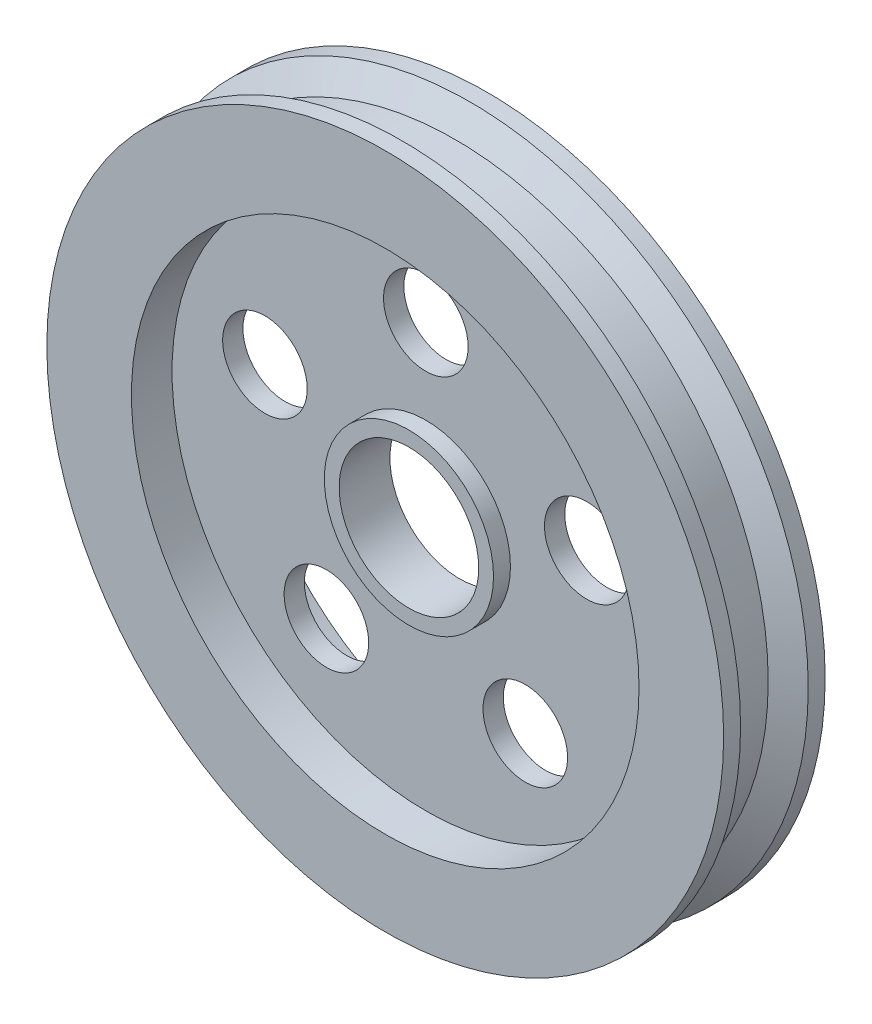
ISO-10303-21;
HEADER;
FILE_DESCRIPTION(('STEP AP214'),'2;1');
FILE_NAME('part.step','',(''),(''),'','','');
FILE_SCHEMA(('AUTOMOTIVE_DESIGN { 1 0 10303 214 1 1 1 1 }'));
ENDSEC;
DATA;
#1=APPLICATION_CONTEXT('core data for automotive mechanical design processes');
#2=APPLICATION_PROTOCOL_DEFINITION('international standard','automotive_design',2000,#1);
#3=PRODUCT_CONTEXT('',#1,'mechanical');
#4=PRODUCT('Part','Part','',(#3));
#5=PRODUCT_RELATED_PRODUCT_CATEGORY('part','',(#4));
#6=PRODUCT_DEFINITION_FORMATION('','',#4);
#7=PRODUCT_DEFINITION_CONTEXT('part definition',#1,'design');
#8=PRODUCT_DEFINITION('design','',#6,#7);
#9=PRODUCT_DEFINITION_SHAPE('','',#8);
#10=(LENGTH_UNIT() NAMED_UNIT(*) SI_UNIT(.MILLI.,.METRE.));
#11=(NAMED_UNIT(*) PLANE_ANGLE_UNIT() SI_UNIT($,.RADIAN.));
#12=(NAMED_UNIT(*) SI_UNIT($,.STERADIAN.) SOLID_ANGLE_UNIT());
#13=UNCERTAINTY_MEASURE_WITH_UNIT(LENGTH_MEASURE(1.E-05),#10,'distance_accuracy_value','');
#14=(GEOMETRIC_REPRESENTATION_CONTEXT(3) GLOBAL_UNCERTAINTY_ASSIGNED_CONTEXT((#13)) GLOBAL_UNIT_ASSIGNED_CONTEXT((#10,
#11,#12)) REPRESENTATION_CONTEXT('',''));
#15=CARTESIAN_POINT('',(0.,0.,0.));
#16=DIRECTION('',(0.,0.,1.));
#17=DIRECTION('',(1.,0.,0.));
#18=AXIS2_PLACEMENT_3D('',#15,#16,#17);
#19=CARTESIAN_POINT('',(0.,0.,3.));
#20=DIRECTION('',(0.,0.,-1.));
#21=DIRECTION('',(-1.,0.,0.));
#22=AXIS2_PLACEMENT_3D('',#19,#20,#21);
#23=CYLINDRICAL_SURFACE('',#22,20.);
#24=CARTESIAN_POINT('',(0.,0.,-2.));
#25=DIRECTION('',(0.,0.,1.));
#26=DIRECTION('',(1.,0.,0.));
#27=AXIS2_PLACEMENT_3D('',#24,#25,#26);
#28=CIRCLE('',#27,20.);
#29=CARTESIAN_POINT('',(20.,0.,-2.));
#30=VERTEX_POINT('',#29);
#31=EDGE_CURVE('E68',#30,#30,#28,.T.);
#32=ORIENTED_EDGE('',*,*,#31,.F.);
#33=EDGE_LOOP('',(#32));
#34=FACE_BOUND('',#33,.T.);
#35=CARTESIAN_POINT('',(0.,0.,-3.));
#36=DIRECTION('',(0.,0.,1.));
#37=DIRECTION('',(1.,0.,0.));
#38=AXIS2_PLACEMENT_3D('',#35,#36,#37);
#39=CIRCLE('',#38,20.);
#40=CARTESIAN_POINT('',(20.,0.,-3.));
#41=VERTEX_POINT('',#40);
#42=EDGE_CURVE('E108',#41,#41,#39,.T.);
#43=ORIENTED_EDGE('',*,*,#42,.T.);
#44=EDGE_LOOP('',(#43));
#45=FACE_BOUND('',#44,.T.);
#46=ADVANCED_FACE('F37',(#34,#45),#23,.T.);
#47=CARTESIAN_POINT('',(0.,0.,3.));
#48=DIRECTION('',(0.,0.,1.));
#49=DIRECTION('',(1.,0.,0.));
#50=AXIS2_PLACEMENT_3D('',#47,#48,#49);
#51=PLANE('',#50);
#52=CARTESIAN_POINT('',(0.,0.,3.));
#53=DIRECTION('',(0.,0.,1.));
#54=DIRECTION('',(1.,0.,0.));
#55=AXIS2_PLACEMENT_3D('',#52,#53,#54);
#56=CIRCLE('',#55,15.);
#57=CARTESIAN_POINT('',(15.,0.,3.));
#58=VERTEX_POINT('',#57);
#59=EDGE_CURVE('E99',#58,#58,#56,.T.);
#60=ORIENTED_EDGE('',*,*,#59,.F.);
#61=EDGE_LOOP('',(#60));
#62=FACE_BOUND('',#61,.T.);
#63=CARTESIAN_POINT('',(0.,0.,3.));
#64=DIRECTION('',(0.,0.,1.));
#65=DIRECTION('',(1.,0.,0.));
#66=AXIS2_PLACEMENT_3D('',#63,#64,#65);
#67=CIRCLE('',#66,20.);
#68=CARTESIAN_POINT('',(20.,0.,3.));
#69=VERTEX_POINT('',#68);
#70=EDGE_CURVE('E51',#69,#69,#67,.T.);
#71=ORIENTED_EDGE('',*,*,#70,.T.);
#72=EDGE_LOOP('',(#71));
#73=FACE_BOUND('',#72,.T.);
#74=ADVANCED_FACE('F164',(#62,#73),#51,.T.);
#75=CARTESIAN_POINT('',(0.,0.,-3.));
#76=DIRECTION('',(0.,0.,1.));
#77=DIRECTION('',(1.,0.,0.));
#78=AXIS2_PLACEMENT_3D('',#75,#76,#77);
#79=PLANE('',#78);
#80=CARTESIAN_POINT('',(0.,0.,-3.));
#81=DIRECTION('',(0.,0.,1.));
#82=DIRECTION('',(1.,0.,0.));
#83=AXIS2_PLACEMENT_3D('',#80,#81,#82);
#84=CIRCLE('',#83,15.);
#85=CARTESIAN_POINT('',(15.,0.,-3.));
#86=VERTEX_POINT('',#85);
#87=EDGE_CURVE('E100',#86,#86,#84,.T.);
#88=ORIENTED_EDGE('',*,*,#87,.T.);
#89=EDGE_LOOP('',(#88));
#90=FACE_BOUND('',#89,.T.);
#91=ORIENTED_EDGE('',*,*,#42,.F.);
#92=EDGE_LOOP('',(#91));
#93=FACE_BOUND('',#92,.T.);
#94=ADVANCED_FACE('F161',(#90,#93),#79,.F.);
#95=CARTESIAN_POINT('',(0.,0.,2.));
#96=DIRECTION('',(0.,0.,1.));
#97=DIRECTION('',(1.,0.,0.));
#98=AXIS2_PLACEMENT_3D('',#95,#96,#97);
#99=CIRCLE('',#98,20.);
#100=CARTESIAN_POINT('',(20.,0.,2.));
#101=VERTEX_POINT('',#100);
#102=EDGE_CURVE('E56',#101,#101,#99,.T.);
#103=ORIENTED_EDGE('',*,*,#102,.T.);
#104=EDGE_LOOP('',(#103));
#105=FACE_BOUND('',#104,.T.);
#106=ORIENTED_EDGE('',*,*,#70,.F.);
#107=EDGE_LOOP('',(#106));
#108=FACE_BOUND('',#107,.T.);
#109=ADVANCED_FACE('F39',(#105,#108),#23,.T.);
#110=CARTESIAN_POINT('',(0.,0.,0.6));
#111=DIRECTION('',(0.,0.,1.));
#112=DIRECTION('',(1.,0.,0.));
#113=AXIS2_PLACEMENT_3D('',#110,#111,#112);
#114=CYLINDRICAL_SURFACE('',#113,15.);
#115=CARTESIAN_POINT('',(0.,0.,0.6));
#116=DIRECTION('',(0.,0.,1.));
#117=DIRECTION('',(1.,0.,0.));
#118=AXIS2_PLACEMENT_3D('',#115,#116,#117);
#119=CIRCLE('',#118,15.);
#120=CARTESIAN_POINT('',(15.,0.,0.6));
#121=VERTEX_POINT('',#120);
#122=EDGE_CURVE('E104',#121,#121,#119,.T.);
#123=ORIENTED_EDGE('',*,*,#122,.F.);
#124=EDGE_LOOP('',(#123));
#125=FACE_BOUND('',#124,.T.);
#126=ORIENTED_EDGE('',*,*,#59,.T.);
#127=EDGE_LOOP('',(#126));
#128=FACE_BOUND('',#127,.T.);
#129=ADVANCED_FACE('F176',(#125,#128),#114,.F.);
#130=CARTESIAN_POINT('',(0.,0.,0.6));
#131=DIRECTION('',(0.,0.,1.));
#132=DIRECTION('',(1.,0.,0.));
#133=AXIS2_PLACEMENT_3D('',#130,#131,#132);
#134=PLANE('',#133);
#135=CARTESIAN_POINT('',(0.,0.,0.6));
#136=DIRECTION('',(0.,0.,1.));
#137=DIRECTION('',(1.,0.,0.));
#138=AXIS2_PLACEMENT_3D('',#135,#136,#137);
#139=CIRCLE('',#138,5.);
#140=CARTESIAN_POINT('',(5.,0.,0.6));
#141=VERTEX_POINT('',#140);
#142=EDGE_CURVE('E10',#141,#141,#139,.T.);
#143=ORIENTED_EDGE('',*,*,#142,.F.);
#144=EDGE_LOOP('',(#143));
#145=FACE_BOUND('',#144,.T.);
#146=CARTESIAN_POINT('',(9.5105651629515,3.09016994374958,0.6));
#147=DIRECTION('',(0.,0.,1.));
#148=DIRECTION('',(0.309016994374958,-0.95105651629515,0.));
#149=AXIS2_PLACEMENT_3D('',#146,#147,#148);
#150=CIRCLE('',#149,2.5);
#151=CARTESIAN_POINT('',(10.2831076488889,0.712528653011706,0.6));
#152=VERTEX_POINT('',#151);
#153=EDGE_CURVE('E72',#152,#152,#150,.T.);
#154=ORIENTED_EDGE('',*,*,#153,.F.);
#155=EDGE_LOOP('',(#154));
#156=FACE_BOUND('',#155,.T.);
#157=CARTESIAN_POINT('',(5.8778525229248,-8.09016994374942,0.6));
#158=DIRECTION('',(0.,0.,1.));
#159=DIRECTION('',(-0.809016994374942,-0.58778525229248,0.));
#160=AXIS2_PLACEMENT_3D('',#157,#158,#159);
#161=CIRCLE('',#160,2.5);
#162=CARTESIAN_POINT('',(3.85531003698745,-9.55963307448062,0.6));
#163=VERTEX_POINT('',#162);
#164=EDGE_CURVE('E78',#163,#163,#161,.T.);
#165=ORIENTED_EDGE('',*,*,#164,.F.);
#166=EDGE_LOOP('',(#165));
#167=FACE_BOUND('',#166,.T.);
#168=CARTESIAN_POINT('',(-5.87785252292469,-8.09016994374951,0.6));
#169=DIRECTION('',(0.,0.,1.));
#170=DIRECTION('',(-0.809016994374951,0.587785252292469,0.));
#171=AXIS2_PLACEMENT_3D('',#168,#169,#170);
#172=CIRCLE('',#171,2.5);
#173=CARTESIAN_POINT('',(-7.90039500886206,-6.62070681301834,0.6));
#174=VERTEX_POINT('',#173);
#175=EDGE_CURVE('E73',#174,#174,#172,.T.);
#176=ORIENTED_EDGE('',*,*,#175,.F.);
#177=EDGE_LOOP('',(#176));
#178=FACE_BOUND('',#177,.T.);
#179=CARTESIAN_POINT('',(-9.51056516295155,3.09016994374945,0.6));
#180=DIRECTION('',(0.,0.,1.));
#181=DIRECTION('',(0.309016994374945,0.951056516295155,0.));
#182=AXIS2_PLACEMENT_3D('',#179,#180,#181);
#183=CIRCLE('',#182,2.5);
#184=CARTESIAN_POINT('',(-8.73802267701418,5.46781123448734,0.6));
#185=VERTEX_POINT('',#184);
#186=EDGE_CURVE('E77',#185,#185,#183,.T.);
#187=ORIENTED_EDGE('',*,*,#186,.F.);
#188=EDGE_LOOP('',(#187));
#189=FACE_BOUND('',#188,.T.);
#190=CARTESIAN_POINT('',(0.,10.,0.6));
#191=DIRECTION('',(0.,0.,1.));
#192=DIRECTION('',(1.,0.,0.));
#193=AXIS2_PLACEMENT_3D('',#190,#191,#192);
#194=CIRCLE('',#193,2.5);
#195=CARTESIAN_POINT('',(2.5,10.,0.6));
#196=VERTEX_POINT('',#195);
#197=EDGE_CURVE('E89',#196,#196,#194,.T.);
#198=ORIENTED_EDGE('',*,*,#197,.F.);
#199=EDGE_LOOP('',(#198));
#200=FACE_BOUND('',#199,.T.);
#201=ORIENTED_EDGE('',*,*,#122,.T.);
#202=EDGE_LOOP('',(#201));
#203=FACE_BOUND('',#202,.T.);
#204=ADVANCED_FACE('F157',(#145,#156,#167,#178,#189,#200,#203),#134,.T.);
#205=CARTESIAN_POINT('',(0.,0.,-0.6));
#206=DIRECTION('',(0.,0.,-1.));
#207=DIRECTION('',(-1.,0.,0.));
#208=AXIS2_PLACEMENT_3D('',#205,#206,#207);
#209=CYLINDRICAL_SURFACE('',#208,15.);
#210=CARTESIAN_POINT('',(0.,0.,-0.6));
#211=DIRECTION('',(0.,0.,1.));
#212=DIRECTION('',(1.,0.,0.));
#213=AXIS2_PLACEMENT_3D('',#210,#211,#212);
#214=CIRCLE('',#213,15.);
#215=CARTESIAN_POINT('',(15.,0.,-0.6));
#216=VERTEX_POINT('',#215);
#217=EDGE_CURVE('E95',#216,#216,#214,.T.);
#218=ORIENTED_EDGE('',*,*,#217,.T.);
#219=EDGE_LOOP('',(#218));
#220=FACE_BOUND('',#219,.T.);
#221=ORIENTED_EDGE('',*,*,#87,.F.);
#222=EDGE_LOOP('',(#221));
#223=FACE_BOUND('',#222,.T.);
#224=ADVANCED_FACE('F142',(#220,#223),#209,.F.);
#225=CARTESIAN_POINT('',(0.,0.,-0.6));
#226=DIRECTION('',(0.,0.,-1.));
#227=DIRECTION('',(1.,0.,0.));
#228=AXIS2_PLACEMENT_3D('',#225,#226,#227);
#229=PLANE('',#228);
#230=CARTESIAN_POINT('',(0.,0.,-0.6));
#231=DIRECTION('',(0.,0.,-1.));
#232=DIRECTION('',(-1.,0.,0.));
#233=AXIS2_PLACEMENT_3D('',#230,#231,#232);
#234=CIRCLE('',#233,5.);
#235=CARTESIAN_POINT('',(-5.,0.,-0.6));
#236=VERTEX_POINT('',#235);
#237=EDGE_CURVE('E41',#236,#236,#234,.T.);
#238=ORIENTED_EDGE('',*,*,#237,.F.);
#239=EDGE_LOOP('',(#238));
#240=FACE_BOUND('',#239,.T.);
#241=CARTESIAN_POINT('',(9.5105651629515,3.09016994374958,-0.6));
#242=DIRECTION('',(0.,0.,-1.));
#243=DIRECTION('',(-1.,0.,0.));
#244=AXIS2_PLACEMENT_3D('',#241,#242,#243);
#245=CIRCLE('',#244,2.5);
#246=CARTESIAN_POINT('',(7.0105651629515,3.09016994374958,-0.6));
#247=VERTEX_POINT('',#246);
#248=EDGE_CURVE('E94',#247,#247,#245,.T.);
#249=ORIENTED_EDGE('',*,*,#248,.F.);
#250=EDGE_LOOP('',(#249));
#251=FACE_BOUND('',#250,.T.);
#252=CARTESIAN_POINT('',(5.8778525229248,-8.09016994374942,-0.6));
#253=DIRECTION('',(0.,0.,-1.));
#254=DIRECTION('',(-1.,0.,0.));
#255=AXIS2_PLACEMENT_3D('',#252,#253,#254);
#256=CIRCLE('',#255,2.5);
#257=CARTESIAN_POINT('',(3.3778525229248,-8.09016994374942,-0.6));
#258=VERTEX_POINT('',#257);
#259=EDGE_CURVE('E128',#258,#258,#256,.T.);
#260=ORIENTED_EDGE('',*,*,#259,.F.);
#261=EDGE_LOOP('',(#260));
#262=FACE_BOUND('',#261,.T.);
#263=CARTESIAN_POINT('',(-5.87785252292469,-8.09016994374951,-0.6));
#264=DIRECTION('',(0.,0.,-1.));
#265=DIRECTION('',(-1.,0.,0.));
#266=AXIS2_PLACEMENT_3D('',#263,#264,#265);
#267=CIRCLE('',#266,2.5);
#268=CARTESIAN_POINT('',(-8.37785252292469,-8.09016994374951,-0.6));
#269=VERTEX_POINT('',#268);
#270=EDGE_CURVE('E124',#269,#269,#267,.T.);
#271=ORIENTED_EDGE('',*,*,#270,.F.);
#272=EDGE_LOOP('',(#271));
#273=FACE_BOUND('',#272,.T.);
#274=CARTESIAN_POINT('',(-9.51056516295155,3.09016994374945,-0.6));
#275=DIRECTION('',(0.,0.,-1.));
#276=DIRECTION('',(-1.,0.,0.));
#277=AXIS2_PLACEMENT_3D('',#274,#275,#276);
#278=CIRCLE('',#277,2.5);
#279=CARTESIAN_POINT('',(-12.0105651629515,3.09016994374945,-0.6));
#280=VERTEX_POINT('',#279);
#281=EDGE_CURVE('E88',#280,#280,#278,.T.);
#282=ORIENTED_EDGE('',*,*,#281,.F.);
#283=EDGE_LOOP('',(#282));
#284=FACE_BOUND('',#283,.T.);
#285=CARTESIAN_POINT('',(0.,10.,-0.6));
#286=DIRECTION('',(0.,0.,-1.));
#287=DIRECTION('',(-1.,0.,0.));
#288=AXIS2_PLACEMENT_3D('',#285,#286,#287);
#289=CIRCLE('',#288,2.5);
#290=CARTESIAN_POINT('',(-2.5,10.,-0.6));
#291=VERTEX_POINT('',#290);
#292=EDGE_CURVE('E93',#291,#291,#289,.T.);
#293=ORIENTED_EDGE('',*,*,#292,.F.);
#294=EDGE_LOOP('',(#293));
#295=FACE_BOUND('',#294,.T.);
#296=ORIENTED_EDGE('',*,*,#217,.F.);
#297=EDGE_LOOP('',(#296));
#298=FACE_BOUND('',#297,.T.);
#299=ADVANCED_FACE('F138',(#240,#251,#262,#273,#284,#295,#298),#229,.T.);
#300=CARTESIAN_POINT('',(0.,10.,-3.));
#301=DIRECTION('',(0.,0.,1.));
#302=DIRECTION('',(1.,0.,0.));
#303=AXIS2_PLACEMENT_3D('',#300,#301,#302);
#304=CYLINDRICAL_SURFACE('',#303,2.5);
#305=ORIENTED_EDGE('',*,*,#292,.T.);
#306=EDGE_LOOP('',(#305));
#307=FACE_BOUND('',#306,.T.);
#308=ORIENTED_EDGE('',*,*,#197,.T.);
#309=EDGE_LOOP('',(#308));
#310=FACE_BOUND('',#309,.T.);
#311=ADVANCED_FACE('F141',(#307,#310),#304,.F.);
#312=CARTESIAN_POINT('',(-9.51056516295155,3.09016994374945,-3.));
#313=DIRECTION('',(0.,0.,1.));
#314=DIRECTION('',(1.,0.,0.));
#315=AXIS2_PLACEMENT_3D('',#312,#313,#314);
#316=CYLINDRICAL_SURFACE('',#315,2.5);
#317=ORIENTED_EDGE('',*,*,#281,.T.);
#318=EDGE_LOOP('',(#317));
#319=FACE_BOUND('',#318,.T.);
#320=ORIENTED_EDGE('',*,*,#186,.T.);
#321=EDGE_LOOP('',(#320));
#322=FACE_BOUND('',#321,.T.);
#323=ADVANCED_FACE('F214',(#319,#322),#316,.F.);
#324=CARTESIAN_POINT('',(-5.87785252292469,-8.09016994374951,-3.));
#325=DIRECTION('',(0.,0.,1.));
#326=DIRECTION('',(1.,0.,0.));
#327=AXIS2_PLACEMENT_3D('',#324,#325,#326);
#328=CYLINDRICAL_SURFACE('',#327,2.5);
#329=ORIENTED_EDGE('',*,*,#270,.T.);
#330=EDGE_LOOP('',(#329));
#331=FACE_BOUND('',#330,.T.);
#332=ORIENTED_EDGE('',*,*,#175,.T.);
#333=EDGE_LOOP('',(#332));
#334=FACE_BOUND('',#333,.T.);
#335=ADVANCED_FACE('F211',(#331,#334),#328,.F.);
#336=CARTESIAN_POINT('',(5.8778525229248,-8.09016994374942,-3.));
#337=DIRECTION('',(0.,0.,1.));
#338=DIRECTION('',(1.,0.,0.));
#339=AXIS2_PLACEMENT_3D('',#336,#337,#338);
#340=CYLINDRICAL_SURFACE('',#339,2.5);
#341=ORIENTED_EDGE('',*,*,#259,.T.);
#342=EDGE_LOOP('',(#341));
#343=FACE_BOUND('',#342,.T.);
#344=ORIENTED_EDGE('',*,*,#164,.T.);
#345=EDGE_LOOP('',(#344));
#346=FACE_BOUND('',#345,.T.);
#347=ADVANCED_FACE('F208',(#343,#346),#340,.F.);
#348=CARTESIAN_POINT('',(9.5105651629515,3.09016994374958,-3.));
#349=DIRECTION('',(0.,0.,1.));
#350=DIRECTION('',(1.,0.,0.));
#351=AXIS2_PLACEMENT_3D('',#348,#349,#350);
#352=CYLINDRICAL_SURFACE('',#351,2.5);
#353=ORIENTED_EDGE('',*,*,#248,.T.);
#354=EDGE_LOOP('',(#353));
#355=FACE_BOUND('',#354,.T.);
#356=ORIENTED_EDGE('',*,*,#153,.T.);
#357=EDGE_LOOP('',(#356));
#358=FACE_BOUND('',#357,.T.);
#359=ADVANCED_FACE('F135',(#355,#358),#352,.F.);
#360=CARTESIAN_POINT('',(0.,0.,-2.));
#361=DIRECTION('',(0.,0.,-1.));
#362=DIRECTION('',(-1.,0.,0.));
#363=AXIS2_PLACEMENT_3D('',#360,#361,#362);
#364=CONICAL_SURFACE('',#363,20.,1.04719755119659);
#365=CARTESIAN_POINT('',(0.,0.,-1.13397459621555));
#366=DIRECTION('',(0.,0.,1.));
#367=DIRECTION('',(1.,0.,0.));
#368=AXIS2_PLACEMENT_3D('',#365,#366,#367);
#369=CIRCLE('',#368,18.5);
#370=CARTESIAN_POINT('',(18.5,0.,-1.13397459621555));
#371=VERTEX_POINT('',#370);
#372=EDGE_CURVE('E64',#371,#371,#369,.T.);
#373=ORIENTED_EDGE('',*,*,#372,.F.);
#374=EDGE_LOOP('',(#373));
#375=FACE_BOUND('',#374,.T.);
#376=ORIENTED_EDGE('',*,*,#31,.T.);
#377=EDGE_LOOP('',(#376));
#378=FACE_BOUND('',#377,.T.);
#379=ADVANCED_FACE('F198',(#375,#378),#364,.T.);
#380=CARTESIAN_POINT('',(0.,0.,0.));
#381=DIRECTION('',(0.,0.,1.));
#382=DIRECTION('',(1.,0.,0.));
#383=AXIS2_PLACEMENT_3D('',#380,#381,#382);
#384=CYLINDRICAL_SURFACE('',#383,18.5);
#385=CARTESIAN_POINT('',(0.,0.,1.13397459621555));
#386=DIRECTION('',(0.,0.,1.));
#387=DIRECTION('',(1.,0.,0.));
#388=AXIS2_PLACEMENT_3D('',#385,#386,#387);
#389=CIRCLE('',#388,18.5);
#390=CARTESIAN_POINT('',(18.5,0.,1.13397459621555));
#391=VERTEX_POINT('',#390);
#392=EDGE_CURVE('E60',#391,#391,#389,.T.);
#393=ORIENTED_EDGE('',*,*,#392,.F.);
#394=EDGE_LOOP('',(#393));
#395=FACE_BOUND('',#394,.T.);
#396=ORIENTED_EDGE('',*,*,#372,.T.);
#397=EDGE_LOOP('',(#396));
#398=FACE_BOUND('',#397,.T.);
#399=ADVANCED_FACE('F192',(#395,#398),#384,.T.);
#400=CARTESIAN_POINT('',(0.,0.,1.13397459621555));
#401=DIRECTION('',(0.,0.,1.));
#402=DIRECTION('',(1.,0.,0.));
#403=AXIS2_PLACEMENT_3D('',#400,#401,#402);
#404=CONICAL_SURFACE('',#403,18.5,1.04719755119659);
#405=ORIENTED_EDGE('',*,*,#102,.F.);
#406=EDGE_LOOP('',(#405));
#407=FACE_BOUND('',#406,.T.);
#408=ORIENTED_EDGE('',*,*,#392,.T.);
#409=EDGE_LOOP('',(#408));
#410=FACE_BOUND('',#409,.T.);
#411=ADVANCED_FACE('F188',(#407,#410),#404,.T.);
#412=CARTESIAN_POINT('',(0.,0.,-1.4));
#413=DIRECTION('',(0.,0.,1.));
#414=DIRECTION('',(1.,0.,0.));
#415=AXIS2_PLACEMENT_3D('',#412,#413,#414);
#416=PLANE('',#415);
#417=CARTESIAN_POINT('',(0.,0.,-1.4));
#418=DIRECTION('',(0.,0.,1.));
#419=DIRECTION('',(1.,0.,0.));
#420=AXIS2_PLACEMENT_3D('',#417,#418,#419);
#421=CIRCLE('',#420,4.125);
#422=CARTESIAN_POINT('',(4.125,0.,-1.4));
#423=VERTEX_POINT('',#422);
#424=EDGE_CURVE('E361',#423,#423,#421,.T.);
#425=ORIENTED_EDGE('',*,*,#424,.T.);
#426=EDGE_LOOP('',(#425));
#427=FACE_BOUND('',#426,.T.);
#428=CARTESIAN_POINT('',(0.,0.,-1.4));
#429=DIRECTION('',(0.,0.,1.));
#430=DIRECTION('',(1.,0.,0.));
#431=AXIS2_PLACEMENT_3D('',#428,#429,#430);
#432=CIRCLE('',#431,5.);
#433=CARTESIAN_POINT('',(5.,0.,-1.4));
#434=VERTEX_POINT('',#433);
#435=EDGE_CURVE('E54',#434,#434,#432,.T.);
#436=ORIENTED_EDGE('',*,*,#435,.F.);
#437=EDGE_LOOP('',(#436));
#438=FACE_BOUND('',#437,.T.);
#439=ADVANCED_FACE('F191',(#427,#438),#416,.F.);
#440=CARTESIAN_POINT('',(0.,0.,-1.4));
#441=DIRECTION('',(0.,0.,1.));
#442=DIRECTION('',(1.,0.,0.));
#443=AXIS2_PLACEMENT_3D('',#440,#441,#442);
#444=CYLINDRICAL_SURFACE('',#443,5.);
#445=ORIENTED_EDGE('',*,*,#237,.T.);
#446=EDGE_LOOP('',(#445));
#447=FACE_BOUND('',#446,.T.);
#448=ORIENTED_EDGE('',*,*,#435,.T.);
#449=EDGE_LOOP('',(#448));
#450=FACE_BOUND('',#449,.T.);
#451=ADVANCED_FACE('F314',(#447,#450),#444,.T.);
#452=ORIENTED_EDGE('',*,*,#142,.T.);
#453=EDGE_LOOP('',(#452));
#454=FACE_BOUND('',#453,.T.);
#455=CARTESIAN_POINT('',(0.,0.,1.6));
#456=DIRECTION('',(0.,0.,1.));
#457=DIRECTION('',(1.,0.,0.));
#458=AXIS2_PLACEMENT_3D('',#455,#456,#457);
#459=CIRCLE('',#458,5.);
#460=CARTESIAN_POINT('',(5.,0.,1.6));
#461=VERTEX_POINT('',#460);
#462=EDGE_CURVE('E363',#461,#461,#459,.T.);
#463=ORIENTED_EDGE('',*,*,#462,.F.);
#464=EDGE_LOOP('',(#463));
#465=FACE_BOUND('',#464,.T.);
#466=ADVANCED_FACE('F322',(#454,#465),#444,.T.);
#467=CARTESIAN_POINT('',(0.,0.,1.6));
#468=DIRECTION('',(0.,0.,1.));
#469=DIRECTION('',(1.,0.,0.));
#470=AXIS2_PLACEMENT_3D('',#467,#468,#469);
#471=PLANE('',#470);
#472=CARTESIAN_POINT('',(0.,0.,1.6));
#473=DIRECTION('',(0.,0.,1.));
#474=DIRECTION('',(1.,0.,0.));
#475=AXIS2_PLACEMENT_3D('',#472,#473,#474);
#476=CIRCLE('',#475,4.125);
#477=CARTESIAN_POINT('',(4.125,0.,1.6));
#478=VERTEX_POINT('',#477);
#479=EDGE_CURVE('E358',#478,#478,#476,.T.);
#480=ORIENTED_EDGE('',*,*,#479,.F.);
#481=EDGE_LOOP('',(#480));
#482=FACE_BOUND('',#481,.T.);
#483=ORIENTED_EDGE('',*,*,#462,.T.);
#484=EDGE_LOOP('',(#483));
#485=FACE_BOUND('',#484,.T.);
#486=ADVANCED_FACE('F329',(#482,#485),#471,.T.);
#487=CARTESIAN_POINT('',(0.,0.,-3.));
#488=DIRECTION('',(0.,0.,1.));
#489=DIRECTION('',(1.,0.,0.));
#490=AXIS2_PLACEMENT_3D('',#487,#488,#489);
#491=CYLINDRICAL_SURFACE('',#490,4.125);
#492=ORIENTED_EDGE('',*,*,#479,.T.);
#493=EDGE_LOOP('',(#492));
#494=FACE_BOUND('',#493,.T.);
#495=ORIENTED_EDGE('',*,*,#424,.F.);
#496=EDGE_LOOP('',(#495));
#497=FACE_BOUND('',#496,.T.);
#498=ADVANCED_FACE('F334',(#494,#497),#491,.F.);
#499=CLOSED_SHELL('',(#46,#74,#94,#109,#129,#204,#224,#299,#311,#323,#335,#347,#359,#379,#399,
#411,#439,#451,#466,#486,#498));
#500=MANIFOLD_SOLID_BREP('B2',#499);
#501=ADVANCED_BREP_SHAPE_REPRESENTATION('',(#18,#500),#14);
#502=SHAPE_DEFINITION_REPRESENTATION(#9,#501);
ENDSEC;
END-ISO-10303-21;
